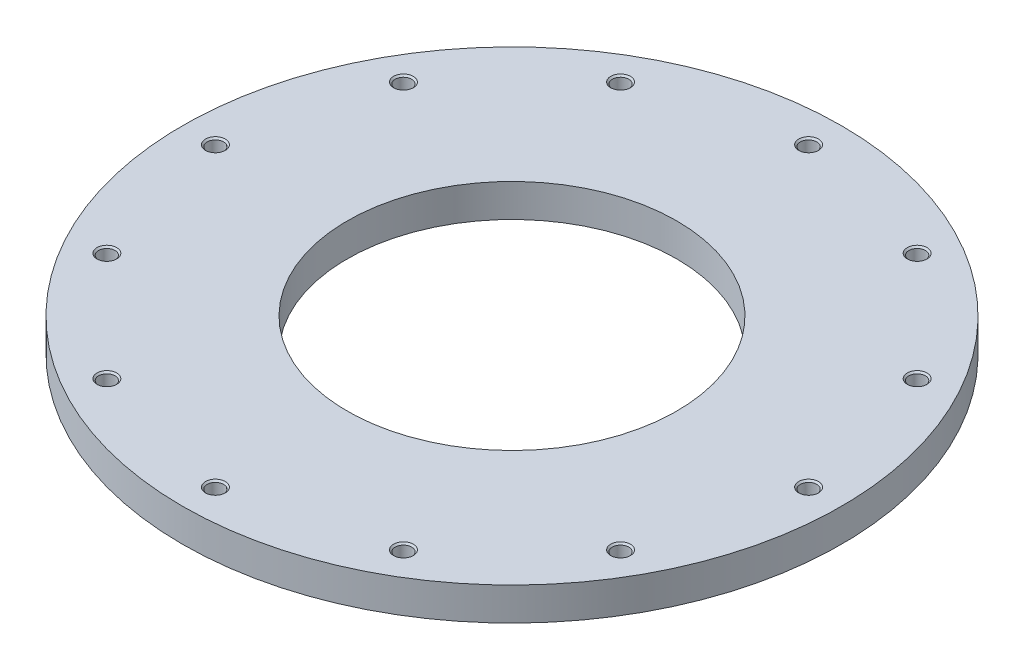
ISO-10303-21;
HEADER;
FILE_DESCRIPTION(('STEP AP214'),'2;1');
FILE_NAME('part.step','',(''),(''),'','','');
FILE_SCHEMA(('AUTOMOTIVE_DESIGN { 1 0 10303 214 1 1 1 1 }'));
ENDSEC;
DATA;
#1=APPLICATION_CONTEXT('core data for automotive mechanical design processes');
#2=APPLICATION_PROTOCOL_DEFINITION('international standard','automotive_design',2000,#1);
#3=PRODUCT_CONTEXT('',#1,'mechanical');
#4=PRODUCT('Part','Part','',(#3));
#5=PRODUCT_RELATED_PRODUCT_CATEGORY('part','',(#4));
#6=PRODUCT_DEFINITION_FORMATION('','',#4);
#7=PRODUCT_DEFINITION_CONTEXT('part definition',#1,'design');
#8=PRODUCT_DEFINITION('design','',#6,#7);
#9=PRODUCT_DEFINITION_SHAPE('','',#8);
#10=(LENGTH_UNIT() NAMED_UNIT(*) SI_UNIT(.MILLI.,.METRE.));
#11=(NAMED_UNIT(*) PLANE_ANGLE_UNIT() SI_UNIT($,.RADIAN.));
#12=(NAMED_UNIT(*) SI_UNIT($,.STERADIAN.) SOLID_ANGLE_UNIT());
#13=UNCERTAINTY_MEASURE_WITH_UNIT(LENGTH_MEASURE(1.E-05),#10,'distance_accuracy_value','');
#14=(GEOMETRIC_REPRESENTATION_CONTEXT(3) GLOBAL_UNCERTAINTY_ASSIGNED_CONTEXT((#13)) GLOBAL_UNIT_ASSIGNED_CONTEXT((#10,
#11,#12)) REPRESENTATION_CONTEXT('',''));
#15=CARTESIAN_POINT('',(0.,0.,0.));
#16=DIRECTION('',(0.,0.,1.));
#17=DIRECTION('',(1.,0.,0.));
#18=AXIS2_PLACEMENT_3D('',#15,#16,#17);
#19=CARTESIAN_POINT('',(0.,0.,0.));
#20=DIRECTION('',(0.,-1.,0.));
#21=DIRECTION('',(0.,0.,-1.));
#22=AXIS2_PLACEMENT_3D('',#19,#20,#21);
#23=PLANE('',#22);
#24=CARTESIAN_POINT('',(98.9867036525621,0.,-57.1499999999987));
#25=DIRECTION('',(0.,1.,0.));
#26=DIRECTION('',(0.,0.,1.));
#27=AXIS2_PLACEMENT_3D('',#24,#25,#26);
#28=CIRCLE('',#27,3.80999999999999);
#29=CARTESIAN_POINT('',(98.9867036525621,0.,-53.3399999999987));
#30=VERTEX_POINT('',#29);
#31=EDGE_CURVE('E203',#30,#30,#28,.T.);
#32=ORIENTED_EDGE('',*,*,#31,.F.);
#33=EDGE_LOOP('',(#32));
#34=FACE_BOUND('',#33,.T.);
#35=CARTESIAN_POINT('',(57.1500000000011,0.,-98.9867036525607));
#36=DIRECTION('',(0.,1.,0.));
#37=DIRECTION('',(0.,0.,1.));
#38=AXIS2_PLACEMENT_3D('',#35,#36,#37);
#39=CIRCLE('',#38,3.81);
#40=CARTESIAN_POINT('',(57.1500000000011,0.,-95.1767036525607));
#41=VERTEX_POINT('',#40);
#42=EDGE_CURVE('E191',#41,#41,#39,.T.);
#43=ORIENTED_EDGE('',*,*,#42,.F.);
#44=EDGE_LOOP('',(#43));
#45=FACE_BOUND('',#44,.T.);
#46=CARTESIAN_POINT('',(1.19722895108931E-12,0.,-114.3));
#47=DIRECTION('',(0.,1.,0.));
#48=DIRECTION('',(0.,0.,1.));
#49=AXIS2_PLACEMENT_3D('',#46,#47,#48);
#50=CIRCLE('',#49,3.81);
#51=CARTESIAN_POINT('',(1.19722895108931E-12,0.,-110.49));
#52=VERTEX_POINT('',#51);
#53=EDGE_CURVE('E179',#52,#52,#50,.T.);
#54=ORIENTED_EDGE('',*,*,#53,.F.);
#55=EDGE_LOOP('',(#54));
#56=FACE_BOUND('',#55,.T.);
#57=CARTESIAN_POINT('',(-57.1499999999991,0.,-98.9867036525619));
#58=DIRECTION('',(0.,1.,0.));
#59=DIRECTION('',(0.,0.,1.));
#60=AXIS2_PLACEMENT_3D('',#57,#58,#59);
#61=CIRCLE('',#60,3.81);
#62=CARTESIAN_POINT('',(-57.1499999999991,0.,-95.1767036525619));
#63=VERTEX_POINT('',#62);
#64=EDGE_CURVE('E167',#63,#63,#61,.T.);
#65=ORIENTED_EDGE('',*,*,#64,.F.);
#66=EDGE_LOOP('',(#65));
#67=FACE_BOUND('',#66,.T.);
#68=CARTESIAN_POINT('',(-98.9867036525609,0.,-57.1500000000008));
#69=DIRECTION('',(0.,1.,0.));
#70=DIRECTION('',(0.,0.,1.));
#71=AXIS2_PLACEMENT_3D('',#68,#69,#70);
#72=CIRCLE('',#71,3.80999999999999);
#73=CARTESIAN_POINT('',(-98.9867036525609,0.,-53.3400000000008));
#74=VERTEX_POINT('',#73);
#75=EDGE_CURVE('E155',#74,#74,#72,.T.);
#76=ORIENTED_EDGE('',*,*,#75,.F.);
#77=EDGE_LOOP('',(#76));
#78=FACE_BOUND('',#77,.T.);
#79=CARTESIAN_POINT('',(-114.3,0.,0.));
#80=DIRECTION('',(0.,1.,0.));
#81=DIRECTION('',(0.,0.,1.));
#82=AXIS2_PLACEMENT_3D('',#79,#80,#81);
#83=CIRCLE('',#82,3.80999999999999);
#84=CARTESIAN_POINT('',(-114.3,0.,3.80999999999999));
#85=VERTEX_POINT('',#84);
#86=EDGE_CURVE('E143',#85,#85,#83,.T.);
#87=ORIENTED_EDGE('',*,*,#86,.F.);
#88=EDGE_LOOP('',(#87));
#89=FACE_BOUND('',#88,.T.);
#90=CARTESIAN_POINT('',(-57.1500000000005,0.,98.9867036525611));
#91=DIRECTION('',(0.,1.,0.));
#92=DIRECTION('',(0.,0.,1.));
#93=AXIS2_PLACEMENT_3D('',#90,#91,#92);
#94=CIRCLE('',#93,3.81);
#95=CARTESIAN_POINT('',(-57.1500000000005,0.,102.796703652561));
#96=VERTEX_POINT('',#95);
#97=EDGE_CURVE('E119',#96,#96,#94,.T.);
#98=ORIENTED_EDGE('',*,*,#97,.F.);
#99=EDGE_LOOP('',(#98));
#100=FACE_BOUND('',#99,.T.);
#101=CARTESIAN_POINT('',(-3.9907631702977E-13,0.,114.3));
#102=DIRECTION('',(0.,1.,0.));
#103=DIRECTION('',(0.,0.,1.));
#104=AXIS2_PLACEMENT_3D('',#101,#102,#103);
#105=CIRCLE('',#104,3.81);
#106=CARTESIAN_POINT('',(-3.9907631702977E-13,0.,118.11));
#107=VERTEX_POINT('',#106);
#108=EDGE_CURVE('E107',#107,#107,#105,.T.);
#109=ORIENTED_EDGE('',*,*,#108,.F.);
#110=EDGE_LOOP('',(#109));
#111=FACE_BOUND('',#110,.T.);
#112=CARTESIAN_POINT('',(57.1499999999998,0.,98.9867036525615));
#113=DIRECTION('',(0.,1.,0.));
#114=DIRECTION('',(0.,0.,1.));
#115=AXIS2_PLACEMENT_3D('',#112,#113,#114);
#116=CIRCLE('',#115,3.81);
#117=CARTESIAN_POINT('',(57.1499999999998,0.,102.796703652561));
#118=VERTEX_POINT('',#117);
#119=EDGE_CURVE('E95',#118,#118,#116,.T.);
#120=ORIENTED_EDGE('',*,*,#119,.F.);
#121=EDGE_LOOP('',(#120));
#122=FACE_BOUND('',#121,.T.);
#123=CARTESIAN_POINT('',(98.9867036525613,0.,57.1500000000001));
#124=DIRECTION('',(0.,1.,0.));
#125=DIRECTION('',(0.,0.,1.));
#126=AXIS2_PLACEMENT_3D('',#123,#124,#125);
#127=CIRCLE('',#126,3.80999999999999);
#128=CARTESIAN_POINT('',(98.9867036525613,0.,60.9600000000001));
#129=VERTEX_POINT('',#128);
#130=EDGE_CURVE('E83',#129,#129,#127,.T.);
#131=ORIENTED_EDGE('',*,*,#130,.F.);
#132=EDGE_LOOP('',(#131));
#133=FACE_BOUND('',#132,.T.);
#134=CARTESIAN_POINT('',(114.3,0.,0.));
#135=DIRECTION('',(0.,1.,0.));
#136=DIRECTION('',(0.,0.,1.));
#137=AXIS2_PLACEMENT_3D('',#134,#135,#136);
#138=CIRCLE('',#137,3.80999999999999);
#139=CARTESIAN_POINT('',(114.3,0.,3.80999999999999));
#140=VERTEX_POINT('',#139);
#141=EDGE_CURVE('E71',#140,#140,#138,.T.);
#142=ORIENTED_EDGE('',*,*,#141,.F.);
#143=EDGE_LOOP('',(#142));
#144=FACE_BOUND('',#143,.T.);
#145=CARTESIAN_POINT('',(0.,0.,0.));
#146=DIRECTION('',(0.,-1.,0.));
#147=DIRECTION('',(0.,0.,-1.));
#148=AXIS2_PLACEMENT_3D('',#145,#146,#147);
#149=CIRCLE('',#148,127.);
#150=CARTESIAN_POINT('',(0.,0.,-127.));
#151=VERTEX_POINT('',#150);
#152=EDGE_CURVE('E52',#151,#151,#149,.T.);
#153=ORIENTED_EDGE('',*,*,#152,.F.);
#154=EDGE_LOOP('',(#153));
#155=FACE_BOUND('',#154,.T.);
#156=CARTESIAN_POINT('',(0.,0.,0.));
#157=DIRECTION('',(0.,-1.,0.));
#158=DIRECTION('',(0.,0.,-1.));
#159=AXIS2_PLACEMENT_3D('',#156,#157,#158);
#160=CIRCLE('',#159,63.5);
#161=CARTESIAN_POINT('',(0.,0.,-63.5));
#162=VERTEX_POINT('',#161);
#163=EDGE_CURVE('E47',#162,#162,#160,.T.);
#164=ORIENTED_EDGE('',*,*,#163,.T.);
#165=EDGE_LOOP('',(#164));
#166=FACE_BOUND('',#165,.T.);
#167=CARTESIAN_POINT('',(-98.9867036525617,0.,57.1499999999994));
#168=DIRECTION('',(0.,1.,0.));
#169=DIRECTION('',(0.,0.,1.));
#170=AXIS2_PLACEMENT_3D('',#167,#168,#169);
#171=CIRCLE('',#170,3.80999999999999);
#172=CARTESIAN_POINT('',(-98.9867036525617,0.,60.9599999999994));
#173=VERTEX_POINT('',#172);
#174=EDGE_CURVE('E131',#173,#173,#171,.T.);
#175=ORIENTED_EDGE('',*,*,#174,.F.);
#176=EDGE_LOOP('',(#175));
#177=FACE_BOUND('',#176,.T.);
#178=ADVANCED_FACE('F39',(#34,#45,#56,#67,#78,#89,#100,#111,#122,#133,#144,#155,#166,#177),#23,.F.);
#179=CARTESIAN_POINT('',(0.,-12.7,0.));
#180=DIRECTION('',(0.,1.,0.));
#181=DIRECTION('',(0.,0.,1.));
#182=AXIS2_PLACEMENT_3D('',#179,#180,#181);
#183=PLANE('',#182);
#184=CARTESIAN_POINT('',(98.9867036525621,-12.7,-57.1499999999987));
#185=DIRECTION('',(0.,1.,0.));
#186=DIRECTION('',(0.,0.,1.));
#187=AXIS2_PLACEMENT_3D('',#184,#185,#186);
#188=CIRCLE('',#187,3.175);
#189=CARTESIAN_POINT('',(98.9867036525621,-12.7,-53.9749999999987));
#190=VERTEX_POINT('',#189);
#191=EDGE_CURVE('E195',#190,#190,#188,.T.);
#192=ORIENTED_EDGE('',*,*,#191,.T.);
#193=EDGE_LOOP('',(#192));
#194=FACE_BOUND('',#193,.T.);
#195=CARTESIAN_POINT('',(57.1500000000011,-12.7,-98.9867036525607));
#196=DIRECTION('',(0.,1.,0.));
#197=DIRECTION('',(0.,0.,1.));
#198=AXIS2_PLACEMENT_3D('',#195,#196,#197);
#199=CIRCLE('',#198,3.175);
#200=CARTESIAN_POINT('',(57.1500000000011,-12.7,-95.8117036525607));
#201=VERTEX_POINT('',#200);
#202=EDGE_CURVE('E183',#201,#201,#199,.T.);
#203=ORIENTED_EDGE('',*,*,#202,.T.);
#204=EDGE_LOOP('',(#203));
#205=FACE_BOUND('',#204,.T.);
#206=CARTESIAN_POINT('',(1.19722895108931E-12,-12.7,-114.3));
#207=DIRECTION('',(0.,1.,0.));
#208=DIRECTION('',(0.,0.,1.));
#209=AXIS2_PLACEMENT_3D('',#206,#207,#208);
#210=CIRCLE('',#209,3.175);
#211=CARTESIAN_POINT('',(1.19722895108931E-12,-12.7,-111.125));
#212=VERTEX_POINT('',#211);
#213=EDGE_CURVE('E171',#212,#212,#210,.T.);
#214=ORIENTED_EDGE('',*,*,#213,.T.);
#215=EDGE_LOOP('',(#214));
#216=FACE_BOUND('',#215,.T.);
#217=CARTESIAN_POINT('',(-57.1499999999991,-12.7,-98.9867036525619));
#218=DIRECTION('',(0.,1.,0.));
#219=DIRECTION('',(0.,0.,1.));
#220=AXIS2_PLACEMENT_3D('',#217,#218,#219);
#221=CIRCLE('',#220,3.175);
#222=CARTESIAN_POINT('',(-57.1499999999991,-12.7,-95.8117036525619));
#223=VERTEX_POINT('',#222);
#224=EDGE_CURVE('E159',#223,#223,#221,.T.);
#225=ORIENTED_EDGE('',*,*,#224,.T.);
#226=EDGE_LOOP('',(#225));
#227=FACE_BOUND('',#226,.T.);
#228=CARTESIAN_POINT('',(-98.9867036525609,-12.7,-57.1500000000008));
#229=DIRECTION('',(0.,1.,0.));
#230=DIRECTION('',(0.,0.,1.));
#231=AXIS2_PLACEMENT_3D('',#228,#229,#230);
#232=CIRCLE('',#231,3.175);
#233=CARTESIAN_POINT('',(-98.9867036525609,-12.7,-53.9750000000008));
#234=VERTEX_POINT('',#233);
#235=EDGE_CURVE('E147',#234,#234,#232,.T.);
#236=ORIENTED_EDGE('',*,*,#235,.T.);
#237=EDGE_LOOP('',(#236));
#238=FACE_BOUND('',#237,.T.);
#239=CARTESIAN_POINT('',(-114.3,-12.7,0.));
#240=DIRECTION('',(0.,1.,0.));
#241=DIRECTION('',(0.,0.,1.));
#242=AXIS2_PLACEMENT_3D('',#239,#240,#241);
#243=CIRCLE('',#242,3.175);
#244=CARTESIAN_POINT('',(-114.3,-12.7,3.175));
#245=VERTEX_POINT('',#244);
#246=EDGE_CURVE('E135',#245,#245,#243,.T.);
#247=ORIENTED_EDGE('',*,*,#246,.T.);
#248=EDGE_LOOP('',(#247));
#249=FACE_BOUND('',#248,.T.);
#250=CARTESIAN_POINT('',(-98.9867036525617,-12.7,57.1499999999994));
#251=DIRECTION('',(0.,1.,0.));
#252=DIRECTION('',(0.,0.,1.));
#253=AXIS2_PLACEMENT_3D('',#250,#251,#252);
#254=CIRCLE('',#253,3.175);
#255=CARTESIAN_POINT('',(-98.9867036525617,-12.7,60.3249999999994));
#256=VERTEX_POINT('',#255);
#257=EDGE_CURVE('E123',#256,#256,#254,.T.);
#258=ORIENTED_EDGE('',*,*,#257,.T.);
#259=EDGE_LOOP('',(#258));
#260=FACE_BOUND('',#259,.T.);
#261=CARTESIAN_POINT('',(-57.1500000000005,-12.7,98.9867036525611));
#262=DIRECTION('',(0.,1.,0.));
#263=DIRECTION('',(0.,0.,1.));
#264=AXIS2_PLACEMENT_3D('',#261,#262,#263);
#265=CIRCLE('',#264,3.175);
#266=CARTESIAN_POINT('',(-57.1500000000005,-12.7,102.161703652561));
#267=VERTEX_POINT('',#266);
#268=EDGE_CURVE('E111',#267,#267,#265,.T.);
#269=ORIENTED_EDGE('',*,*,#268,.T.);
#270=EDGE_LOOP('',(#269));
#271=FACE_BOUND('',#270,.T.);
#272=CARTESIAN_POINT('',(-3.9907631702977E-13,-12.7,114.3));
#273=DIRECTION('',(0.,1.,0.));
#274=DIRECTION('',(0.,0.,1.));
#275=AXIS2_PLACEMENT_3D('',#272,#273,#274);
#276=CIRCLE('',#275,3.175);
#277=CARTESIAN_POINT('',(-3.9907631702977E-13,-12.7,117.475));
#278=VERTEX_POINT('',#277);
#279=EDGE_CURVE('E99',#278,#278,#276,.T.);
#280=ORIENTED_EDGE('',*,*,#279,.T.);
#281=EDGE_LOOP('',(#280));
#282=FACE_BOUND('',#281,.T.);
#283=CARTESIAN_POINT('',(57.1499999999998,-12.7,98.9867036525615));
#284=DIRECTION('',(0.,1.,0.));
#285=DIRECTION('',(0.,0.,1.));
#286=AXIS2_PLACEMENT_3D('',#283,#284,#285);
#287=CIRCLE('',#286,3.175);
#288=CARTESIAN_POINT('',(57.1499999999998,-12.7,102.161703652561));
#289=VERTEX_POINT('',#288);
#290=EDGE_CURVE('E87',#289,#289,#287,.T.);
#291=ORIENTED_EDGE('',*,*,#290,.T.);
#292=EDGE_LOOP('',(#291));
#293=FACE_BOUND('',#292,.T.);
#294=CARTESIAN_POINT('',(98.9867036525613,-12.7,57.1500000000001));
#295=DIRECTION('',(0.,1.,0.));
#296=DIRECTION('',(0.,0.,1.));
#297=AXIS2_PLACEMENT_3D('',#294,#295,#296);
#298=CIRCLE('',#297,3.175);
#299=CARTESIAN_POINT('',(98.9867036525613,-12.7,60.3250000000001));
#300=VERTEX_POINT('',#299);
#301=EDGE_CURVE('E75',#300,#300,#298,.T.);
#302=ORIENTED_EDGE('',*,*,#301,.T.);
#303=EDGE_LOOP('',(#302));
#304=FACE_BOUND('',#303,.T.);
#305=CARTESIAN_POINT('',(114.3,-12.7,0.));
#306=DIRECTION('',(0.,1.,0.));
#307=DIRECTION('',(0.,0.,1.));
#308=AXIS2_PLACEMENT_3D('',#305,#306,#307);
#309=CIRCLE('',#308,3.175);
#310=CARTESIAN_POINT('',(114.3,-12.7,3.175));
#311=VERTEX_POINT('',#310);
#312=EDGE_CURVE('E63',#311,#311,#309,.T.);
#313=ORIENTED_EDGE('',*,*,#312,.T.);
#314=EDGE_LOOP('',(#313));
#315=FACE_BOUND('',#314,.T.);
#316=CARTESIAN_POINT('',(0.,-12.7,0.));
#317=DIRECTION('',(0.,-1.,0.));
#318=DIRECTION('',(0.,0.,-1.));
#319=AXIS2_PLACEMENT_3D('',#316,#317,#318);
#320=CIRCLE('',#319,63.5);
#321=CARTESIAN_POINT('',(0.,-12.7,-63.5));
#322=VERTEX_POINT('',#321);
#323=EDGE_CURVE('E10',#322,#322,#320,.T.);
#324=ORIENTED_EDGE('',*,*,#323,.F.);
#325=EDGE_LOOP('',(#324));
#326=FACE_BOUND('',#325,.T.);
#327=CARTESIAN_POINT('',(0.,-12.7,0.));
#328=DIRECTION('',(0.,-1.,0.));
#329=DIRECTION('',(0.,0.,-1.));
#330=AXIS2_PLACEMENT_3D('',#327,#328,#329);
#331=CIRCLE('',#330,127.);
#332=CARTESIAN_POINT('',(0.,-12.7,-127.));
#333=VERTEX_POINT('',#332);
#334=EDGE_CURVE('E57',#333,#333,#331,.T.);
#335=ORIENTED_EDGE('',*,*,#334,.T.);
#336=EDGE_LOOP('',(#335));
#337=FACE_BOUND('',#336,.T.);
#338=ADVANCED_FACE('F41',(#194,#205,#216,#227,#238,#249,#260,#271,#282,#293,#304,#315,#326,
#337),#183,.F.);
#339=CARTESIAN_POINT('',(0.,0.,0.));
#340=DIRECTION('',(0.,-1.,0.));
#341=DIRECTION('',(0.,0.,-1.));
#342=AXIS2_PLACEMENT_3D('',#339,#340,#341);
#343=CYLINDRICAL_SURFACE('',#342,63.5);
#344=ORIENTED_EDGE('',*,*,#163,.F.);
#345=EDGE_LOOP('',(#344));
#346=FACE_BOUND('',#345,.T.);
#347=ORIENTED_EDGE('',*,*,#323,.T.);
#348=EDGE_LOOP('',(#347));
#349=FACE_BOUND('',#348,.T.);
#350=ADVANCED_FACE('F297',(#346,#349),#343,.F.);
#351=CARTESIAN_POINT('',(0.,0.,0.));
#352=DIRECTION('',(0.,-1.,0.));
#353=DIRECTION('',(0.,0.,-1.));
#354=AXIS2_PLACEMENT_3D('',#351,#352,#353);
#355=CYLINDRICAL_SURFACE('',#354,127.);
#356=ORIENTED_EDGE('',*,*,#334,.F.);
#357=EDGE_LOOP('',(#356));
#358=FACE_BOUND('',#357,.T.);
#359=ORIENTED_EDGE('',*,*,#152,.T.);
#360=EDGE_LOOP('',(#359));
#361=FACE_BOUND('',#360,.T.);
#362=ADVANCED_FACE('F294',(#358,#361),#355,.T.);
#363=CARTESIAN_POINT('',(114.3,0.,0.));
#364=DIRECTION('',(0.,1.,0.));
#365=DIRECTION('',(0.,0.,1.));
#366=AXIS2_PLACEMENT_3D('',#363,#364,#365);
#367=CYLINDRICAL_SURFACE('',#366,3.175);
#368=ORIENTED_EDGE('',*,*,#312,.F.);
#369=EDGE_LOOP('',(#368));
#370=FACE_BOUND('',#369,.T.);
#371=CARTESIAN_POINT('',(114.3,-0.635000000000001,0.));
#372=DIRECTION('',(0.,1.,0.));
#373=DIRECTION('',(0.,0.,1.));
#374=AXIS2_PLACEMENT_3D('',#371,#372,#373);
#375=CIRCLE('',#374,3.175);
#376=CARTESIAN_POINT('',(114.3,-0.635000000000001,3.175));
#377=VERTEX_POINT('',#376);
#378=EDGE_CURVE('E67',#377,#377,#375,.T.);
#379=ORIENTED_EDGE('',*,*,#378,.T.);
#380=EDGE_LOOP('',(#379));
#381=FACE_BOUND('',#380,.T.);
#382=ADVANCED_FACE('F290',(#370,#381),#367,.F.);
#383=CARTESIAN_POINT('',(114.3,0.,0.));
#384=DIRECTION('',(0.,1.,0.));
#385=DIRECTION('',(0.,0.,1.));
#386=AXIS2_PLACEMENT_3D('',#383,#384,#385);
#387=CONICAL_SURFACE('',#386,3.80999999999999,0.785398163397444);
#388=ORIENTED_EDGE('',*,*,#378,.F.);
#389=EDGE_LOOP('',(#388));
#390=FACE_BOUND('',#389,.T.);
#391=ORIENTED_EDGE('',*,*,#141,.T.);
#392=EDGE_LOOP('',(#391));
#393=FACE_BOUND('',#392,.T.);
#394=ADVANCED_FACE('F286',(#390,#393),#387,.F.);
#395=CARTESIAN_POINT('',(98.9867036525613,0.,57.1500000000001));
#396=DIRECTION('',(0.,1.,0.));
#397=DIRECTION('',(0.,0.,1.));
#398=AXIS2_PLACEMENT_3D('',#395,#396,#397);
#399=CYLINDRICAL_SURFACE('',#398,3.175);
#400=ORIENTED_EDGE('',*,*,#301,.F.);
#401=EDGE_LOOP('',(#400));
#402=FACE_BOUND('',#401,.T.);
#403=CARTESIAN_POINT('',(98.9867036525613,-0.635000000000001,57.1500000000001));
#404=DIRECTION('',(0.,1.,0.));
#405=DIRECTION('',(0.,0.,1.));
#406=AXIS2_PLACEMENT_3D('',#403,#404,#405);
#407=CIRCLE('',#406,3.175);
#408=CARTESIAN_POINT('',(98.9867036525613,-0.635000000000001,60.3250000000001));
#409=VERTEX_POINT('',#408);
#410=EDGE_CURVE('E79',#409,#409,#407,.T.);
#411=ORIENTED_EDGE('',*,*,#410,.T.);
#412=EDGE_LOOP('',(#411));
#413=FACE_BOUND('',#412,.T.);
#414=ADVANCED_FACE('F282',(#402,#413),#399,.F.);
#415=CARTESIAN_POINT('',(98.9867036525613,0.,57.1500000000001));
#416=DIRECTION('',(0.,1.,0.));
#417=DIRECTION('',(0.,0.,1.));
#418=AXIS2_PLACEMENT_3D('',#415,#416,#417);
#419=CONICAL_SURFACE('',#418,3.80999999999999,0.785398163397444);
#420=ORIENTED_EDGE('',*,*,#410,.F.);
#421=EDGE_LOOP('',(#420));
#422=FACE_BOUND('',#421,.T.);
#423=ORIENTED_EDGE('',*,*,#130,.T.);
#424=EDGE_LOOP('',(#423));
#425=FACE_BOUND('',#424,.T.);
#426=ADVANCED_FACE('F278',(#422,#425),#419,.F.);
#427=CARTESIAN_POINT('',(57.1499999999998,0.,98.9867036525615));
#428=DIRECTION('',(0.,1.,0.));
#429=DIRECTION('',(0.,0.,1.));
#430=AXIS2_PLACEMENT_3D('',#427,#428,#429);
#431=CYLINDRICAL_SURFACE('',#430,3.175);
#432=ORIENTED_EDGE('',*,*,#290,.F.);
#433=EDGE_LOOP('',(#432));
#434=FACE_BOUND('',#433,.T.);
#435=CARTESIAN_POINT('',(57.1499999999998,-0.635000000000001,98.9867036525615));
#436=DIRECTION('',(0.,1.,0.));
#437=DIRECTION('',(0.,0.,1.));
#438=AXIS2_PLACEMENT_3D('',#435,#436,#437);
#439=CIRCLE('',#438,3.175);
#440=CARTESIAN_POINT('',(57.1499999999998,-0.635000000000001,102.161703652561));
#441=VERTEX_POINT('',#440);
#442=EDGE_CURVE('E91',#441,#441,#439,.T.);
#443=ORIENTED_EDGE('',*,*,#442,.T.);
#444=EDGE_LOOP('',(#443));
#445=FACE_BOUND('',#444,.T.);
#446=ADVANCED_FACE('F274',(#434,#445),#431,.F.);
#447=CARTESIAN_POINT('',(57.1499999999998,0.,98.9867036525615));
#448=DIRECTION('',(0.,1.,0.));
#449=DIRECTION('',(0.,0.,1.));
#450=AXIS2_PLACEMENT_3D('',#447,#448,#449);
#451=CONICAL_SURFACE('',#450,3.81,0.785398163397449);
#452=ORIENTED_EDGE('',*,*,#442,.F.);
#453=EDGE_LOOP('',(#452));
#454=FACE_BOUND('',#453,.T.);
#455=ORIENTED_EDGE('',*,*,#119,.T.);
#456=EDGE_LOOP('',(#455));
#457=FACE_BOUND('',#456,.T.);
#458=ADVANCED_FACE('F270',(#454,#457),#451,.F.);
#459=CARTESIAN_POINT('',(-3.9907631702977E-13,0.,114.3));
#460=DIRECTION('',(0.,1.,0.));
#461=DIRECTION('',(0.,0.,1.));
#462=AXIS2_PLACEMENT_3D('',#459,#460,#461);
#463=CYLINDRICAL_SURFACE('',#462,3.175);
#464=ORIENTED_EDGE('',*,*,#279,.F.);
#465=EDGE_LOOP('',(#464));
#466=FACE_BOUND('',#465,.T.);
#467=CARTESIAN_POINT('',(-3.9907631702977E-13,-0.635000000000001,114.3));
#468=DIRECTION('',(0.,1.,0.));
#469=DIRECTION('',(0.,0.,1.));
#470=AXIS2_PLACEMENT_3D('',#467,#468,#469);
#471=CIRCLE('',#470,3.175);
#472=CARTESIAN_POINT('',(-3.9907631702977E-13,-0.635000000000001,117.475));
#473=VERTEX_POINT('',#472);
#474=EDGE_CURVE('E103',#473,#473,#471,.T.);
#475=ORIENTED_EDGE('',*,*,#474,.T.);
#476=EDGE_LOOP('',(#475));
#477=FACE_BOUND('',#476,.T.);
#478=ADVANCED_FACE('F266',(#466,#477),#463,.F.);
#479=CARTESIAN_POINT('',(-3.9907631702977E-13,0.,114.3));
#480=DIRECTION('',(0.,1.,0.));
#481=DIRECTION('',(0.,0.,1.));
#482=AXIS2_PLACEMENT_3D('',#479,#480,#481);
#483=CONICAL_SURFACE('',#482,3.81,0.785398163397446);
#484=ORIENTED_EDGE('',*,*,#474,.F.);
#485=EDGE_LOOP('',(#484));
#486=FACE_BOUND('',#485,.T.);
#487=ORIENTED_EDGE('',*,*,#108,.T.);
#488=EDGE_LOOP('',(#487));
#489=FACE_BOUND('',#488,.T.);
#490=ADVANCED_FACE('F262',(#486,#489),#483,.F.);
#491=CARTESIAN_POINT('',(-57.1500000000005,0.,98.9867036525611));
#492=DIRECTION('',(0.,1.,0.));
#493=DIRECTION('',(0.,0.,1.));
#494=AXIS2_PLACEMENT_3D('',#491,#492,#493);
#495=CYLINDRICAL_SURFACE('',#494,3.175);
#496=ORIENTED_EDGE('',*,*,#268,.F.);
#497=EDGE_LOOP('',(#496));
#498=FACE_BOUND('',#497,.T.);
#499=CARTESIAN_POINT('',(-57.1500000000005,-0.635000000000001,98.9867036525611));
#500=DIRECTION('',(0.,1.,0.));
#501=DIRECTION('',(0.,0.,1.));
#502=AXIS2_PLACEMENT_3D('',#499,#500,#501);
#503=CIRCLE('',#502,3.175);
#504=CARTESIAN_POINT('',(-57.1500000000005,-0.635000000000001,102.161703652561));
#505=VERTEX_POINT('',#504);
#506=EDGE_CURVE('E115',#505,#505,#503,.T.);
#507=ORIENTED_EDGE('',*,*,#506,.T.);
#508=EDGE_LOOP('',(#507));
#509=FACE_BOUND('',#508,.T.);
#510=ADVANCED_FACE('F258',(#498,#509),#495,.F.);
#511=CARTESIAN_POINT('',(-57.1500000000005,0.,98.9867036525611));
#512=DIRECTION('',(0.,1.,0.));
#513=DIRECTION('',(0.,0.,1.));
#514=AXIS2_PLACEMENT_3D('',#511,#512,#513);
#515=CONICAL_SURFACE('',#514,3.81,0.785398163397449);
#516=ORIENTED_EDGE('',*,*,#506,.F.);
#517=EDGE_LOOP('',(#516));
#518=FACE_BOUND('',#517,.T.);
#519=ORIENTED_EDGE('',*,*,#97,.T.);
#520=EDGE_LOOP('',(#519));
#521=FACE_BOUND('',#520,.T.);
#522=ADVANCED_FACE('F250',(#518,#521),#515,.F.);
#523=CARTESIAN_POINT('',(-98.9867036525617,0.,57.1499999999994));
#524=DIRECTION('',(0.,1.,0.));
#525=DIRECTION('',(0.,0.,1.));
#526=AXIS2_PLACEMENT_3D('',#523,#524,#525);
#527=CYLINDRICAL_SURFACE('',#526,3.175);
#528=ORIENTED_EDGE('',*,*,#257,.F.);
#529=EDGE_LOOP('',(#528));
#530=FACE_BOUND('',#529,.T.);
#531=CARTESIAN_POINT('',(-98.9867036525617,-0.635000000000001,57.1499999999994));
#532=DIRECTION('',(0.,1.,0.));
#533=DIRECTION('',(0.,0.,1.));
#534=AXIS2_PLACEMENT_3D('',#531,#532,#533);
#535=CIRCLE('',#534,3.175);
#536=CARTESIAN_POINT('',(-98.9867036525617,-0.635000000000001,60.3249999999994));
#537=VERTEX_POINT('',#536);
#538=EDGE_CURVE('E127',#537,#537,#535,.T.);
#539=ORIENTED_EDGE('',*,*,#538,.T.);
#540=EDGE_LOOP('',(#539));
#541=FACE_BOUND('',#540,.T.);
#542=ADVANCED_FACE('F240',(#530,#541),#527,.F.);
#543=CARTESIAN_POINT('',(-98.9867036525617,0.,57.1499999999994));
#544=DIRECTION('',(0.,1.,0.));
#545=DIRECTION('',(0.,0.,1.));
#546=AXIS2_PLACEMENT_3D('',#543,#544,#545);
#547=CONICAL_SURFACE('',#546,3.80999999999999,0.785398163397444);
#548=ORIENTED_EDGE('',*,*,#538,.F.);
#549=EDGE_LOOP('',(#548));
#550=FACE_BOUND('',#549,.T.);
#551=ORIENTED_EDGE('',*,*,#174,.T.);
#552=EDGE_LOOP('',(#551));
#553=FACE_BOUND('',#552,.T.);
#554=ADVANCED_FACE('F237',(#550,#553),#547,.F.);
#555=CARTESIAN_POINT('',(-114.3,0.,0.));
#556=DIRECTION('',(0.,1.,0.));
#557=DIRECTION('',(0.,0.,1.));
#558=AXIS2_PLACEMENT_3D('',#555,#556,#557);
#559=CYLINDRICAL_SURFACE('',#558,3.175);
#560=ORIENTED_EDGE('',*,*,#246,.F.);
#561=EDGE_LOOP('',(#560));
#562=FACE_BOUND('',#561,.T.);
#563=CARTESIAN_POINT('',(-114.3,-0.635000000000001,0.));
#564=DIRECTION('',(0.,1.,0.));
#565=DIRECTION('',(0.,0.,1.));
#566=AXIS2_PLACEMENT_3D('',#563,#564,#565);
#567=CIRCLE('',#566,3.175);
#568=CARTESIAN_POINT('',(-114.3,-0.635000000000001,3.175));
#569=VERTEX_POINT('',#568);
#570=EDGE_CURVE('E139',#569,#569,#567,.T.);
#571=ORIENTED_EDGE('',*,*,#570,.T.);
#572=EDGE_LOOP('',(#571));
#573=FACE_BOUND('',#572,.T.);
#574=ADVANCED_FACE('F239',(#562,#573),#559,.F.);
#575=CARTESIAN_POINT('',(-114.3,0.,0.));
#576=DIRECTION('',(0.,1.,0.));
#577=DIRECTION('',(0.,0.,1.));
#578=AXIS2_PLACEMENT_3D('',#575,#576,#577);
#579=CONICAL_SURFACE('',#578,3.80999999999999,0.785398163397444);
#580=ORIENTED_EDGE('',*,*,#570,.F.);
#581=EDGE_LOOP('',(#580));
#582=FACE_BOUND('',#581,.T.);
#583=ORIENTED_EDGE('',*,*,#86,.T.);
#584=EDGE_LOOP('',(#583));
#585=FACE_BOUND('',#584,.T.);
#586=ADVANCED_FACE('F247',(#582,#585),#579,.F.);
#587=CARTESIAN_POINT('',(-98.9867036525609,0.,-57.1500000000008));
#588=DIRECTION('',(0.,1.,0.));
#589=DIRECTION('',(0.,0.,1.));
#590=AXIS2_PLACEMENT_3D('',#587,#588,#589);
#591=CYLINDRICAL_SURFACE('',#590,3.175);
#592=ORIENTED_EDGE('',*,*,#235,.F.);
#593=EDGE_LOOP('',(#592));
#594=FACE_BOUND('',#593,.T.);
#595=CARTESIAN_POINT('',(-98.9867036525609,-0.635000000000001,-57.1500000000008));
#596=DIRECTION('',(0.,1.,0.));
#597=DIRECTION('',(0.,0.,1.));
#598=AXIS2_PLACEMENT_3D('',#595,#596,#597);
#599=CIRCLE('',#598,3.175);
#600=CARTESIAN_POINT('',(-98.9867036525609,-0.635000000000001,-53.9750000000008));
#601=VERTEX_POINT('',#600);
#602=EDGE_CURVE('E151',#601,#601,#599,.T.);
#603=ORIENTED_EDGE('',*,*,#602,.T.);
#604=EDGE_LOOP('',(#603));
#605=FACE_BOUND('',#604,.T.);
#606=ADVANCED_FACE('F355',(#594,#605),#591,.F.);
#607=CARTESIAN_POINT('',(-98.9867036525609,0.,-57.1500000000008));
#608=DIRECTION('',(0.,1.,0.));
#609=DIRECTION('',(0.,0.,1.));
#610=AXIS2_PLACEMENT_3D('',#607,#608,#609);
#611=CONICAL_SURFACE('',#610,3.80999999999999,0.785398163397444);
#612=ORIENTED_EDGE('',*,*,#602,.F.);
#613=EDGE_LOOP('',(#612));
#614=FACE_BOUND('',#613,.T.);
#615=ORIENTED_EDGE('',*,*,#75,.T.);
#616=EDGE_LOOP('',(#615));
#617=FACE_BOUND('',#616,.T.);
#618=ADVANCED_FACE('F359',(#614,#617),#611,.F.);
#619=CARTESIAN_POINT('',(-57.1499999999991,0.,-98.9867036525619));
#620=DIRECTION('',(0.,1.,0.));
#621=DIRECTION('',(0.,0.,1.));
#622=AXIS2_PLACEMENT_3D('',#619,#620,#621);
#623=CYLINDRICAL_SURFACE('',#622,3.175);
#624=ORIENTED_EDGE('',*,*,#224,.F.);
#625=EDGE_LOOP('',(#624));
#626=FACE_BOUND('',#625,.T.);
#627=CARTESIAN_POINT('',(-57.1499999999991,-0.635000000000001,-98.9867036525619));
#628=DIRECTION('',(0.,1.,0.));
#629=DIRECTION('',(0.,0.,1.));
#630=AXIS2_PLACEMENT_3D('',#627,#628,#629);
#631=CIRCLE('',#630,3.175);
#632=CARTESIAN_POINT('',(-57.1499999999991,-0.635000000000001,-95.8117036525619));
#633=VERTEX_POINT('',#632);
#634=EDGE_CURVE('E163',#633,#633,#631,.T.);
#635=ORIENTED_EDGE('',*,*,#634,.T.);
#636=EDGE_LOOP('',(#635));
#637=FACE_BOUND('',#636,.T.);
#638=ADVANCED_FACE('F365',(#626,#637),#623,.F.);
#639=CARTESIAN_POINT('',(-57.1499999999991,0.,-98.9867036525619));
#640=DIRECTION('',(0.,1.,0.));
#641=DIRECTION('',(0.,0.,1.));
#642=AXIS2_PLACEMENT_3D('',#639,#640,#641);
#643=CONICAL_SURFACE('',#642,3.81,0.785398163397449);
#644=ORIENTED_EDGE('',*,*,#634,.F.);
#645=EDGE_LOOP('',(#644));
#646=FACE_BOUND('',#645,.T.);
#647=ORIENTED_EDGE('',*,*,#64,.T.);
#648=EDGE_LOOP('',(#647));
#649=FACE_BOUND('',#648,.T.);
#650=ADVANCED_FACE('F369',(#646,#649),#643,.F.);
#651=CARTESIAN_POINT('',(1.19722895108931E-12,0.,-114.3));
#652=DIRECTION('',(0.,1.,0.));
#653=DIRECTION('',(0.,0.,1.));
#654=AXIS2_PLACEMENT_3D('',#651,#652,#653);
#655=CYLINDRICAL_SURFACE('',#654,3.175);
#656=ORIENTED_EDGE('',*,*,#213,.F.);
#657=EDGE_LOOP('',(#656));
#658=FACE_BOUND('',#657,.T.);
#659=CARTESIAN_POINT('',(1.19722895108931E-12,-0.635000000000001,-114.3));
#660=DIRECTION('',(0.,1.,0.));
#661=DIRECTION('',(0.,0.,1.));
#662=AXIS2_PLACEMENT_3D('',#659,#660,#661);
#663=CIRCLE('',#662,3.175);
#664=CARTESIAN_POINT('',(1.19722895108931E-12,-0.635000000000001,-111.125));
#665=VERTEX_POINT('',#664);
#666=EDGE_CURVE('E175',#665,#665,#663,.T.);
#667=ORIENTED_EDGE('',*,*,#666,.T.);
#668=EDGE_LOOP('',(#667));
#669=FACE_BOUND('',#668,.T.);
#670=ADVANCED_FACE('F373',(#658,#669),#655,.F.);
#671=CARTESIAN_POINT('',(1.19722895108931E-12,0.,-114.3));
#672=DIRECTION('',(0.,1.,0.));
#673=DIRECTION('',(0.,0.,1.));
#674=AXIS2_PLACEMENT_3D('',#671,#672,#673);
#675=CONICAL_SURFACE('',#674,3.81,0.785398163397446);
#676=ORIENTED_EDGE('',*,*,#666,.F.);
#677=EDGE_LOOP('',(#676));
#678=FACE_BOUND('',#677,.T.);
#679=ORIENTED_EDGE('',*,*,#53,.T.);
#680=EDGE_LOOP('',(#679));
#681=FACE_BOUND('',#680,.T.);
#682=ADVANCED_FACE('F377',(#678,#681),#675,.F.);
#683=CARTESIAN_POINT('',(57.1500000000011,0.,-98.9867036525607));
#684=DIRECTION('',(0.,1.,0.));
#685=DIRECTION('',(0.,0.,1.));
#686=AXIS2_PLACEMENT_3D('',#683,#684,#685);
#687=CYLINDRICAL_SURFACE('',#686,3.175);
#688=ORIENTED_EDGE('',*,*,#202,.F.);
#689=EDGE_LOOP('',(#688));
#690=FACE_BOUND('',#689,.T.);
#691=CARTESIAN_POINT('',(57.1500000000011,-0.635000000000001,-98.9867036525607));
#692=DIRECTION('',(0.,1.,0.));
#693=DIRECTION('',(0.,0.,1.));
#694=AXIS2_PLACEMENT_3D('',#691,#692,#693);
#695=CIRCLE('',#694,3.175);
#696=CARTESIAN_POINT('',(57.1500000000011,-0.635000000000001,-95.8117036525607));
#697=VERTEX_POINT('',#696);
#698=EDGE_CURVE('E187',#697,#697,#695,.T.);
#699=ORIENTED_EDGE('',*,*,#698,.T.);
#700=EDGE_LOOP('',(#699));
#701=FACE_BOUND('',#700,.T.);
#702=ADVANCED_FACE('F381',(#690,#701),#687,.F.);
#703=CARTESIAN_POINT('',(57.1500000000011,0.,-98.9867036525607));
#704=DIRECTION('',(0.,1.,0.));
#705=DIRECTION('',(0.,0.,1.));
#706=AXIS2_PLACEMENT_3D('',#703,#704,#705);
#707=CONICAL_SURFACE('',#706,3.81,0.785398163397449);
#708=ORIENTED_EDGE('',*,*,#698,.F.);
#709=EDGE_LOOP('',(#708));
#710=FACE_BOUND('',#709,.T.);
#711=ORIENTED_EDGE('',*,*,#42,.T.);
#712=EDGE_LOOP('',(#711));
#713=FACE_BOUND('',#712,.T.);
#714=ADVANCED_FACE('F385',(#710,#713),#707,.F.);
#715=CARTESIAN_POINT('',(98.9867036525621,0.,-57.1499999999987));
#716=DIRECTION('',(0.,1.,0.));
#717=DIRECTION('',(0.,0.,1.));
#718=AXIS2_PLACEMENT_3D('',#715,#716,#717);
#719=CYLINDRICAL_SURFACE('',#718,3.175);
#720=ORIENTED_EDGE('',*,*,#191,.F.);
#721=EDGE_LOOP('',(#720));
#722=FACE_BOUND('',#721,.T.);
#723=CARTESIAN_POINT('',(98.9867036525621,-0.635000000000001,-57.1499999999987));
#724=DIRECTION('',(0.,1.,0.));
#725=DIRECTION('',(0.,0.,1.));
#726=AXIS2_PLACEMENT_3D('',#723,#724,#725);
#727=CIRCLE('',#726,3.175);
#728=CARTESIAN_POINT('',(98.9867036525621,-0.635000000000001,-53.9749999999987));
#729=VERTEX_POINT('',#728);
#730=EDGE_CURVE('E199',#729,#729,#727,.T.);
#731=ORIENTED_EDGE('',*,*,#730,.T.);
#732=EDGE_LOOP('',(#731));
#733=FACE_BOUND('',#732,.T.);
#734=ADVANCED_FACE('F389',(#722,#733),#719,.F.);
#735=CARTESIAN_POINT('',(98.9867036525621,0.,-57.1499999999987));
#736=DIRECTION('',(0.,1.,0.));
#737=DIRECTION('',(0.,0.,1.));
#738=AXIS2_PLACEMENT_3D('',#735,#736,#737);
#739=CONICAL_SURFACE('',#738,3.80999999999999,0.785398163397444);
#740=ORIENTED_EDGE('',*,*,#730,.F.);
#741=EDGE_LOOP('',(#740));
#742=FACE_BOUND('',#741,.T.);
#743=ORIENTED_EDGE('',*,*,#31,.T.);
#744=EDGE_LOOP('',(#743));
#745=FACE_BOUND('',#744,.T.);
#746=ADVANCED_FACE('F208',(#742,#745),#739,.F.);
#747=CLOSED_SHELL('',(#178,#338,#350,#362,#382,#394,#414,#426,#446,#458,#478,#490,#510,#522,
#542,#554,#574,#586,#606,#618,#638,#650,#670,#682,#702,#714,#734,#746));
#748=MANIFOLD_SOLID_BREP('B2',#747);
#749=ADVANCED_BREP_SHAPE_REPRESENTATION('',(#18,#748),#14);
#750=SHAPE_DEFINITION_REPRESENTATION(#9,#749);
ENDSEC;
END-ISO-10303-21;
